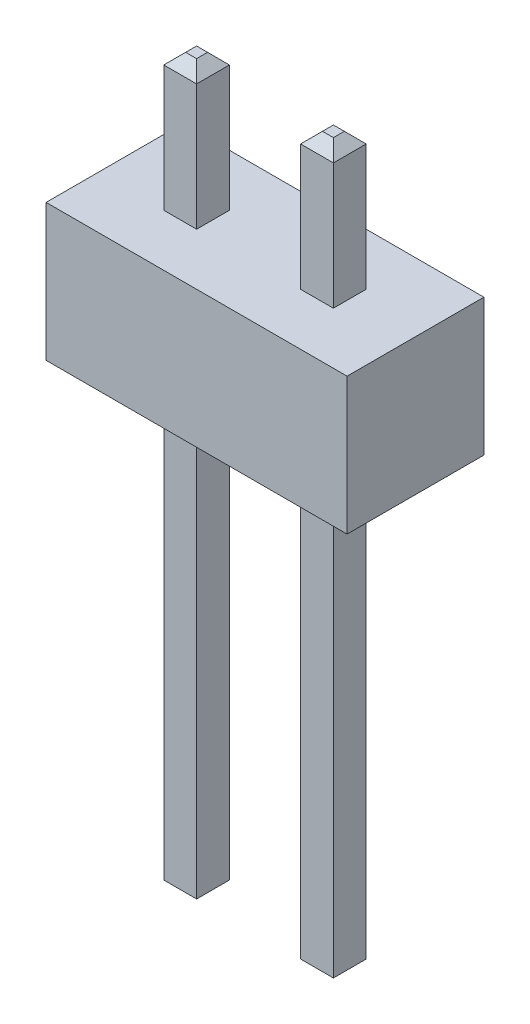
ISO-10303-21;
HEADER;
FILE_DESCRIPTION(('STEP AP214'),'2;1');
FILE_NAME('part.step','',(''),(''),'','','');
FILE_SCHEMA(('AUTOMOTIVE_DESIGN { 1 0 10303 214 1 1 1 1 }'));
ENDSEC;
DATA;
#1=APPLICATION_CONTEXT('core data for automotive mechanical design processes');
#2=APPLICATION_PROTOCOL_DEFINITION('international standard','automotive_design',2000,#1);
#3=PRODUCT_CONTEXT('',#1,'mechanical');
#4=PRODUCT('Part','Part','',(#3));
#5=PRODUCT_RELATED_PRODUCT_CATEGORY('part','',(#4));
#6=PRODUCT_DEFINITION_FORMATION('','',#4);
#7=PRODUCT_DEFINITION_CONTEXT('part definition',#1,'design');
#8=PRODUCT_DEFINITION('design','',#6,#7);
#9=PRODUCT_DEFINITION_SHAPE('','',#8);
#10=(LENGTH_UNIT() NAMED_UNIT(*) SI_UNIT(.MILLI.,.METRE.));
#11=(NAMED_UNIT(*) PLANE_ANGLE_UNIT() SI_UNIT($,.RADIAN.));
#12=(NAMED_UNIT(*) SI_UNIT($,.STERADIAN.) SOLID_ANGLE_UNIT());
#13=UNCERTAINTY_MEASURE_WITH_UNIT(LENGTH_MEASURE(1.E-05),#10,'distance_accuracy_value','');
#14=(GEOMETRIC_REPRESENTATION_CONTEXT(3) GLOBAL_UNCERTAINTY_ASSIGNED_CONTEXT((#13)) GLOBAL_UNIT_ASSIGNED_CONTEXT((#10,
#11,#12)) REPRESENTATION_CONTEXT('',''));
#15=CARTESIAN_POINT('',(0.,0.,0.));
#16=DIRECTION('',(0.,0.,1.));
#17=DIRECTION('',(1.,0.,0.));
#18=AXIS2_PLACEMENT_3D('',#15,#16,#17);
#19=CARTESIAN_POINT('',(0.,2.5,0.));
#20=DIRECTION('',(0.,1.,0.));
#21=DIRECTION('',(0.,0.,1.));
#22=AXIS2_PLACEMENT_3D('',#19,#20,#21);
#23=PLANE('',#22);
#24=DIRECTION('',(0.,0.,1.));
#25=VECTOR('',#24,1.);
#26=CARTESIAN_POINT('',(-1.55,2.5,0.));
#27=LINE('',#26,#25);
#28=CARTESIAN_POINT('',(-1.55,2.5,-0.3));
#29=VERTEX_POINT('',#28);
#30=CARTESIAN_POINT('',(-1.55,2.5,0.3));
#31=VERTEX_POINT('',#30);
#32=EDGE_CURVE('E271',#29,#31,#27,.T.);
#33=ORIENTED_EDGE('',*,*,#32,.F.);
#34=DIRECTION('',(-1.,0.,0.));
#35=VECTOR('',#34,1.);
#36=CARTESIAN_POINT('',(0.,2.5,-0.3));
#37=LINE('',#36,#35);
#38=CARTESIAN_POINT('',(-0.95,2.5,-0.3));
#39=VERTEX_POINT('',#38);
#40=EDGE_CURVE('E268',#39,#29,#37,.T.);
#41=ORIENTED_EDGE('',*,*,#40,.F.);
#42=DIRECTION('',(0.,0.,-1.));
#43=VECTOR('',#42,1.);
#44=CARTESIAN_POINT('',(-0.95,2.5,0.));
#45=LINE('',#44,#43);
#46=CARTESIAN_POINT('',(-0.95,2.5,0.3));
#47=VERTEX_POINT('',#46);
#48=EDGE_CURVE('E265',#47,#39,#45,.T.);
#49=ORIENTED_EDGE('',*,*,#48,.F.);
#50=DIRECTION('',(1.,0.,0.));
#51=VECTOR('',#50,1.);
#52=CARTESIAN_POINT('',(0.,2.5,0.3));
#53=LINE('',#52,#51);
#54=EDGE_CURVE('E252',#31,#47,#53,.T.);
#55=ORIENTED_EDGE('',*,*,#54,.F.);
#56=EDGE_LOOP('',(#33,#41,#49,#55));
#57=FACE_BOUND('',#56,.T.);
#58=DIRECTION('',(0.,0.,1.));
#59=VECTOR('',#58,1.);
#60=CARTESIAN_POINT('',(-2.75,2.5,-1.25));
#61=LINE('',#60,#59);
#62=CARTESIAN_POINT('',(-2.75,2.5,-1.25));
#63=VERTEX_POINT('',#62);
#64=CARTESIAN_POINT('',(-2.75,2.5,1.25));
#65=VERTEX_POINT('',#64);
#66=EDGE_CURVE('E275',#63,#65,#61,.T.);
#67=ORIENTED_EDGE('',*,*,#66,.T.);
#68=DIRECTION('',(1.,0.,0.));
#69=VECTOR('',#68,1.);
#70=CARTESIAN_POINT('',(-2.75,2.5,1.25));
#71=LINE('',#70,#69);
#72=CARTESIAN_POINT('',(2.75,2.5,1.25));
#73=VERTEX_POINT('',#72);
#74=EDGE_CURVE('E278',#65,#73,#71,.T.);
#75=ORIENTED_EDGE('',*,*,#74,.T.);
#76=DIRECTION('',(0.,0.,-1.));
#77=VECTOR('',#76,1.);
#78=CARTESIAN_POINT('',(2.75,2.5,-1.25));
#79=LINE('',#78,#77);
#80=CARTESIAN_POINT('',(2.75,2.5,-1.25));
#81=VERTEX_POINT('',#80);
#82=EDGE_CURVE('E281',#73,#81,#79,.T.);
#83=ORIENTED_EDGE('',*,*,#82,.T.);
#84=DIRECTION('',(-1.,0.,0.));
#85=VECTOR('',#84,1.);
#86=CARTESIAN_POINT('',(-2.75,2.5,-1.25));
#87=LINE('',#86,#85);
#88=EDGE_CURVE('E283',#81,#63,#87,.T.);
#89=ORIENTED_EDGE('',*,*,#88,.T.);
#90=EDGE_LOOP('',(#67,#75,#83,#89));
#91=FACE_BOUND('',#90,.T.);
#92=DIRECTION('',(1.,0.,0.));
#93=VECTOR('',#92,1.);
#94=CARTESIAN_POINT('',(0.,2.5,-0.3));
#95=LINE('',#94,#93);
#96=CARTESIAN_POINT('',(0.95,2.5,-0.3));
#97=VERTEX_POINT('',#96);
#98=CARTESIAN_POINT('',(1.55,2.5,-0.3));
#99=VERTEX_POINT('',#98);
#100=EDGE_CURVE('E221',#97,#99,#95,.T.);
#101=ORIENTED_EDGE('',*,*,#100,.T.);
#102=DIRECTION('',(0.,0.,1.));
#103=VECTOR('',#102,1.);
#104=CARTESIAN_POINT('',(1.55,2.5,0.));
#105=LINE('',#104,#103);
#106=CARTESIAN_POINT('',(1.55,2.5,0.3));
#107=VERTEX_POINT('',#106);
#108=EDGE_CURVE('E244',#99,#107,#105,.T.);
#109=ORIENTED_EDGE('',*,*,#108,.T.);
#110=DIRECTION('',(-1.,0.,0.));
#111=VECTOR('',#110,1.);
#112=CARTESIAN_POINT('',(0.,2.5,0.3));
#113=LINE('',#112,#111);
#114=CARTESIAN_POINT('',(0.95,2.5,0.3));
#115=VERTEX_POINT('',#114);
#116=EDGE_CURVE('E242',#107,#115,#113,.T.);
#117=ORIENTED_EDGE('',*,*,#116,.T.);
#118=DIRECTION('',(0.,0.,-1.));
#119=VECTOR('',#118,1.);
#120=CARTESIAN_POINT('',(0.95,2.5,0.));
#121=LINE('',#120,#119);
#122=EDGE_CURVE('E232',#115,#97,#121,.T.);
#123=ORIENTED_EDGE('',*,*,#122,.T.);
#124=EDGE_LOOP('',(#101,#109,#117,#123));
#125=FACE_BOUND('',#124,.T.);
#126=ADVANCED_FACE('F33',(#57,#91,#125),#23,.T.);
#127=CARTESIAN_POINT('',(0.,0.,0.));
#128=DIRECTION('',(0.,1.,0.));
#129=DIRECTION('',(0.,0.,1.));
#130=AXIS2_PLACEMENT_3D('',#127,#128,#129);
#131=PLANE('',#130);
#132=DIRECTION('',(0.,0.,1.));
#133=VECTOR('',#132,1.);
#134=CARTESIAN_POINT('',(-2.75,0.,-1.25));
#135=LINE('',#134,#133);
#136=CARTESIAN_POINT('',(-2.75,0.,-1.25));
#137=VERTEX_POINT('',#136);
#138=CARTESIAN_POINT('',(-2.75,0.,1.25));
#139=VERTEX_POINT('',#138);
#140=EDGE_CURVE('E274',#137,#139,#135,.T.);
#141=ORIENTED_EDGE('',*,*,#140,.F.);
#142=DIRECTION('',(-1.,0.,0.));
#143=VECTOR('',#142,1.);
#144=CARTESIAN_POINT('',(-2.75,0.,-1.25));
#145=LINE('',#144,#143);
#146=CARTESIAN_POINT('',(2.75,0.,-1.25));
#147=VERTEX_POINT('',#146);
#148=EDGE_CURVE('E279',#147,#137,#145,.T.);
#149=ORIENTED_EDGE('',*,*,#148,.F.);
#150=DIRECTION('',(0.,0.,-1.));
#151=VECTOR('',#150,1.);
#152=CARTESIAN_POINT('',(2.75,0.,-1.25));
#153=LINE('',#152,#151);
#154=CARTESIAN_POINT('',(2.75,0.,1.25));
#155=VERTEX_POINT('',#154);
#156=EDGE_CURVE('E290',#155,#147,#153,.T.);
#157=ORIENTED_EDGE('',*,*,#156,.F.);
#158=DIRECTION('',(1.,0.,0.));
#159=VECTOR('',#158,1.);
#160=CARTESIAN_POINT('',(-2.75,0.,1.25));
#161=LINE('',#160,#159);
#162=EDGE_CURVE('E288',#139,#155,#161,.T.);
#163=ORIENTED_EDGE('',*,*,#162,.F.);
#164=EDGE_LOOP('',(#141,#149,#157,#163));
#165=FACE_BOUND('',#164,.T.);
#166=DIRECTION('',(-1.,0.,0.));
#167=VECTOR('',#166,1.);
#168=CARTESIAN_POINT('',(0.,0.,-0.3));
#169=LINE('',#168,#167);
#170=CARTESIAN_POINT('',(-0.95,0.,-0.3));
#171=VERTEX_POINT('',#170);
#172=CARTESIAN_POINT('',(-1.55,0.,-0.3));
#173=VERTEX_POINT('',#172);
#174=EDGE_CURVE('E310',#171,#173,#169,.T.);
#175=ORIENTED_EDGE('',*,*,#174,.T.);
#176=DIRECTION('',(0.,0.,1.));
#177=VECTOR('',#176,1.);
#178=CARTESIAN_POINT('',(-1.55,0.,0.));
#179=LINE('',#178,#177);
#180=CARTESIAN_POINT('',(-1.55,0.,0.3));
#181=VERTEX_POINT('',#180);
#182=EDGE_CURVE('E313',#173,#181,#179,.T.);
#183=ORIENTED_EDGE('',*,*,#182,.T.);
#184=DIRECTION('',(1.,0.,0.));
#185=VECTOR('',#184,1.);
#186=CARTESIAN_POINT('',(0.,0.,0.3));
#187=LINE('',#186,#185);
#188=CARTESIAN_POINT('',(-0.95,0.,0.3));
#189=VERTEX_POINT('',#188);
#190=EDGE_CURVE('E304',#181,#189,#187,.T.);
#191=ORIENTED_EDGE('',*,*,#190,.T.);
#192=DIRECTION('',(0.,0.,-1.));
#193=VECTOR('',#192,1.);
#194=CARTESIAN_POINT('',(-0.95,0.,0.));
#195=LINE('',#194,#193);
#196=EDGE_CURVE('E307',#189,#171,#195,.T.);
#197=ORIENTED_EDGE('',*,*,#196,.T.);
#198=EDGE_LOOP('',(#175,#183,#191,#197));
#199=FACE_BOUND('',#198,.T.);
#200=DIRECTION('',(0.,0.,1.));
#201=VECTOR('',#200,1.);
#202=CARTESIAN_POINT('',(1.55,0.,0.));
#203=LINE('',#202,#201);
#204=CARTESIAN_POINT('',(1.55,0.,-0.3));
#205=VERTEX_POINT('',#204);
#206=CARTESIAN_POINT('',(1.55,0.,0.3));
#207=VERTEX_POINT('',#206);
#208=EDGE_CURVE('E380',#205,#207,#203,.T.);
#209=ORIENTED_EDGE('',*,*,#208,.F.);
#210=DIRECTION('',(1.,0.,0.));
#211=VECTOR('',#210,1.);
#212=CARTESIAN_POINT('',(0.,0.,-0.3));
#213=LINE('',#212,#211);
#214=CARTESIAN_POINT('',(0.95,0.,-0.3));
#215=VERTEX_POINT('',#214);
#216=EDGE_CURVE('E352',#215,#205,#213,.T.);
#217=ORIENTED_EDGE('',*,*,#216,.F.);
#218=DIRECTION('',(0.,0.,-1.));
#219=VECTOR('',#218,1.);
#220=CARTESIAN_POINT('',(0.95,0.,0.));
#221=LINE('',#220,#219);
#222=CARTESIAN_POINT('',(0.95,0.,0.3));
#223=VERTEX_POINT('',#222);
#224=EDGE_CURVE('E374',#223,#215,#221,.T.);
#225=ORIENTED_EDGE('',*,*,#224,.F.);
#226=DIRECTION('',(-1.,0.,0.));
#227=VECTOR('',#226,1.);
#228=CARTESIAN_POINT('',(0.,0.,0.3));
#229=LINE('',#228,#227);
#230=EDGE_CURVE('E377',#207,#223,#229,.T.);
#231=ORIENTED_EDGE('',*,*,#230,.F.);
#232=EDGE_LOOP('',(#209,#217,#225,#231));
#233=FACE_BOUND('',#232,.T.);
#234=ADVANCED_FACE('F471',(#165,#199,#233),#131,.F.);
#235=CARTESIAN_POINT('',(-2.75,2.5,-1.25));
#236=DIRECTION('',(1.,0.,0.));
#237=DIRECTION('',(0.,0.,-1.));
#238=AXIS2_PLACEMENT_3D('',#235,#236,#237);
#239=PLANE('',#238);
#240=ORIENTED_EDGE('',*,*,#140,.T.);
#241=DIRECTION('',(0.,-1.,0.));
#242=VECTOR('',#241,1.);
#243=CARTESIAN_POINT('',(-2.75,2.5,1.25));
#244=LINE('',#243,#242);
#245=EDGE_CURVE('E301',#65,#139,#244,.T.);
#246=ORIENTED_EDGE('',*,*,#245,.F.);
#247=ORIENTED_EDGE('',*,*,#66,.F.);
#248=DIRECTION('',(0.,-1.,0.));
#249=VECTOR('',#248,1.);
#250=CARTESIAN_POINT('',(-2.75,2.5,-1.25));
#251=LINE('',#250,#249);
#252=EDGE_CURVE('E285',#63,#137,#251,.T.);
#253=ORIENTED_EDGE('',*,*,#252,.T.);
#254=EDGE_LOOP('',(#240,#246,#247,#253));
#255=FACE_BOUND('',#254,.T.);
#256=ADVANCED_FACE('F477',(#255),#239,.F.);
#257=CARTESIAN_POINT('',(-2.75,2.5,1.25));
#258=DIRECTION('',(0.,0.,-1.));
#259=DIRECTION('',(-1.,0.,0.));
#260=AXIS2_PLACEMENT_3D('',#257,#258,#259);
#261=PLANE('',#260);
#262=ORIENTED_EDGE('',*,*,#162,.T.);
#263=DIRECTION('',(0.,-1.,0.));
#264=VECTOR('',#263,1.);
#265=CARTESIAN_POINT('',(2.75,2.5,1.25));
#266=LINE('',#265,#264);
#267=EDGE_CURVE('E298',#73,#155,#266,.T.);
#268=ORIENTED_EDGE('',*,*,#267,.F.);
#269=ORIENTED_EDGE('',*,*,#74,.F.);
#270=ORIENTED_EDGE('',*,*,#245,.T.);
#271=EDGE_LOOP('',(#262,#268,#269,#270));
#272=FACE_BOUND('',#271,.T.);
#273=ADVANCED_FACE('F493',(#272),#261,.F.);
#274=CARTESIAN_POINT('',(2.75,2.5,-1.25));
#275=DIRECTION('',(-1.,0.,0.));
#276=DIRECTION('',(0.,0.,1.));
#277=AXIS2_PLACEMENT_3D('',#274,#275,#276);
#278=PLANE('',#277);
#279=ORIENTED_EDGE('',*,*,#156,.T.);
#280=DIRECTION('',(0.,-1.,0.));
#281=VECTOR('',#280,1.);
#282=CARTESIAN_POINT('',(2.75,2.5,-1.25));
#283=LINE('',#282,#281);
#284=EDGE_CURVE('E295',#81,#147,#283,.T.);
#285=ORIENTED_EDGE('',*,*,#284,.F.);
#286=ORIENTED_EDGE('',*,*,#82,.F.);
#287=ORIENTED_EDGE('',*,*,#267,.T.);
#288=EDGE_LOOP('',(#279,#285,#286,#287));
#289=FACE_BOUND('',#288,.T.);
#290=ADVANCED_FACE('F489',(#289),#278,.F.);
#291=CARTESIAN_POINT('',(-2.75,2.5,-1.25));
#292=DIRECTION('',(0.,0.,1.));
#293=DIRECTION('',(1.,0.,0.));
#294=AXIS2_PLACEMENT_3D('',#291,#292,#293);
#295=PLANE('',#294);
#296=ORIENTED_EDGE('',*,*,#148,.T.);
#297=ORIENTED_EDGE('',*,*,#252,.F.);
#298=ORIENTED_EDGE('',*,*,#88,.F.);
#299=ORIENTED_EDGE('',*,*,#284,.T.);
#300=EDGE_LOOP('',(#296,#297,#298,#299));
#301=FACE_BOUND('',#300,.T.);
#302=ADVANCED_FACE('F485',(#301),#295,.F.);
#303=CARTESIAN_POINT('',(0.,-8.3,0.));
#304=DIRECTION('',(0.,1.,0.));
#305=DIRECTION('',(0.,0.,1.));
#306=AXIS2_PLACEMENT_3D('',#303,#304,#305);
#307=PLANE('',#306);
#308=DIRECTION('',(-1.,0.,0.));
#309=VECTOR('',#308,1.);
#310=CARTESIAN_POINT('',(-1.55,-8.3,0.100000000000001));
#311=LINE('',#310,#309);
#312=CARTESIAN_POINT('',(-1.15,-8.3,0.100000000000001));
#313=VERTEX_POINT('',#312);
#314=CARTESIAN_POINT('',(-1.35,-8.3,0.100000000000001));
#315=VERTEX_POINT('',#314);
#316=EDGE_CURVE('E319',#313,#315,#311,.T.);
#317=ORIENTED_EDGE('',*,*,#316,.T.);
#318=DIRECTION('',(0.,0.,-1.));
#319=VECTOR('',#318,1.);
#320=CARTESIAN_POINT('',(-1.35,-8.3,-0.3));
#321=LINE('',#320,#319);
#322=CARTESIAN_POINT('',(-1.35,-8.3,-0.100000000000001));
#323=VERTEX_POINT('',#322);
#324=EDGE_CURVE('E325',#315,#323,#321,.T.);
#325=ORIENTED_EDGE('',*,*,#324,.T.);
#326=DIRECTION('',(1.,0.,0.));
#327=VECTOR('',#326,1.);
#328=CARTESIAN_POINT('',(-0.95,-8.3,-0.100000000000001));
#329=LINE('',#328,#327);
#330=CARTESIAN_POINT('',(-1.15,-8.3,-0.100000000000001));
#331=VERTEX_POINT('',#330);
#332=EDGE_CURVE('E323',#323,#331,#329,.T.);
#333=ORIENTED_EDGE('',*,*,#332,.T.);
#334=DIRECTION('',(0.,0.,1.));
#335=VECTOR('',#334,1.);
#336=CARTESIAN_POINT('',(-1.15,-8.3,0.3));
#337=LINE('',#336,#335);
#338=EDGE_CURVE('E321',#331,#313,#337,.T.);
#339=ORIENTED_EDGE('',*,*,#338,.T.);
#340=EDGE_LOOP('',(#317,#325,#333,#339));
#341=FACE_BOUND('',#340,.T.);
#342=ADVANCED_FACE('F488',(#341),#307,.F.);
#343=CARTESIAN_POINT('',(-1.55,-8.3,0.3));
#344=DIRECTION('',(0.,0.,1.));
#345=DIRECTION('',(1.,0.,0.));
#346=AXIS2_PLACEMENT_3D('',#343,#344,#345);
#347=PLANE('',#346);
#348=DIRECTION('',(0.,1.,0.));
#349=VECTOR('',#348,1.);
#350=CARTESIAN_POINT('',(-1.55,-8.3,0.3));
#351=LINE('',#350,#349);
#352=CARTESIAN_POINT('',(-1.55,-8.1,0.3));
#353=VERTEX_POINT('',#352);
#354=EDGE_CURVE('E260',#353,#181,#351,.T.);
#355=ORIENTED_EDGE('',*,*,#354,.F.);
#356=DIRECTION('',(1.,0.,0.));
#357=VECTOR('',#356,1.);
#358=CARTESIAN_POINT('',(-0.95,-8.1,0.3));
#359=LINE('',#358,#357);
#360=CARTESIAN_POINT('',(-0.95,-8.1,0.3));
#361=VERTEX_POINT('',#360);
#362=EDGE_CURVE('E332',#353,#361,#359,.T.);
#363=ORIENTED_EDGE('',*,*,#362,.T.);
#364=DIRECTION('',(0.,1.,0.));
#365=VECTOR('',#364,1.);
#366=CARTESIAN_POINT('',(-0.95,-8.3,0.3));
#367=LINE('',#366,#365);
#368=EDGE_CURVE('E257',#361,#189,#367,.T.);
#369=ORIENTED_EDGE('',*,*,#368,.T.);
#370=ORIENTED_EDGE('',*,*,#190,.F.);
#371=EDGE_LOOP('',(#355,#363,#369,#370));
#372=FACE_BOUND('',#371,.T.);
#373=ADVANCED_FACE('F720',(#372),#347,.T.);
#374=CARTESIAN_POINT('',(-0.95,-8.3,-0.3));
#375=DIRECTION('',(1.,0.,0.));
#376=DIRECTION('',(0.,0.,-1.));
#377=AXIS2_PLACEMENT_3D('',#374,#375,#376);
#378=PLANE('',#377);
#379=ORIENTED_EDGE('',*,*,#368,.F.);
#380=DIRECTION('',(0.,0.,-1.));
#381=VECTOR('',#380,1.);
#382=CARTESIAN_POINT('',(-0.95,-8.1,-0.3));
#383=LINE('',#382,#381);
#384=CARTESIAN_POINT('',(-0.95,-8.1,-0.3));
#385=VERTEX_POINT('',#384);
#386=EDGE_CURVE('E330',#361,#385,#383,.T.);
#387=ORIENTED_EDGE('',*,*,#386,.T.);
#388=DIRECTION('',(0.,1.,0.));
#389=VECTOR('',#388,1.);
#390=CARTESIAN_POINT('',(-0.95,-8.3,-0.3));
#391=LINE('',#390,#389);
#392=EDGE_CURVE('E254',#385,#171,#391,.T.);
#393=ORIENTED_EDGE('',*,*,#392,.T.);
#394=ORIENTED_EDGE('',*,*,#196,.F.);
#395=EDGE_LOOP('',(#379,#387,#393,#394));
#396=FACE_BOUND('',#395,.T.);
#397=ADVANCED_FACE('F731',(#396),#378,.T.);
#398=CARTESIAN_POINT('',(-1.55,-8.3,-0.3));
#399=DIRECTION('',(0.,0.,-1.));
#400=DIRECTION('',(-1.,0.,0.));
#401=AXIS2_PLACEMENT_3D('',#398,#399,#400);
#402=PLANE('',#401);
#403=ORIENTED_EDGE('',*,*,#392,.F.);
#404=DIRECTION('',(-1.,0.,0.));
#405=VECTOR('',#404,1.);
#406=CARTESIAN_POINT('',(-1.55,-8.1,-0.3));
#407=LINE('',#406,#405);
#408=CARTESIAN_POINT('',(-1.55,-8.1,-0.3));
#409=VERTEX_POINT('',#408);
#410=EDGE_CURVE('E328',#385,#409,#407,.T.);
#411=ORIENTED_EDGE('',*,*,#410,.T.);
#412=DIRECTION('',(0.,1.,0.));
#413=VECTOR('',#412,1.);
#414=CARTESIAN_POINT('',(-1.55,-8.3,-0.3));
#415=LINE('',#414,#413);
#416=EDGE_CURVE('E250',#409,#173,#415,.T.);
#417=ORIENTED_EDGE('',*,*,#416,.T.);
#418=ORIENTED_EDGE('',*,*,#174,.F.);
#419=EDGE_LOOP('',(#403,#411,#417,#418));
#420=FACE_BOUND('',#419,.T.);
#421=ADVANCED_FACE('F741',(#420),#402,.T.);
#422=CARTESIAN_POINT('',(-1.55,-8.3,-0.3));
#423=DIRECTION('',(-1.,0.,0.));
#424=DIRECTION('',(0.,0.,1.));
#425=AXIS2_PLACEMENT_3D('',#422,#423,#424);
#426=PLANE('',#425);
#427=ORIENTED_EDGE('',*,*,#416,.F.);
#428=DIRECTION('',(0.,0.,1.));
#429=VECTOR('',#428,1.);
#430=CARTESIAN_POINT('',(-1.55,-8.1,0.3));
#431=LINE('',#430,#429);
#432=EDGE_CURVE('E316',#409,#353,#431,.T.);
#433=ORIENTED_EDGE('',*,*,#432,.T.);
#434=ORIENTED_EDGE('',*,*,#354,.T.);
#435=ORIENTED_EDGE('',*,*,#182,.F.);
#436=EDGE_LOOP('',(#427,#433,#434,#435));
#437=FACE_BOUND('',#436,.T.);
#438=ADVANCED_FACE('F749',(#437),#426,.T.);
#439=CARTESIAN_POINT('',(-1.55,4.8,0.3));
#440=VERTEX_POINT('',#439);
#441=EDGE_CURVE('E262',#31,#440,#351,.T.);
#442=ORIENTED_EDGE('',*,*,#441,.T.);
#443=DIRECTION('',(0.,0.,-1.));
#444=VECTOR('',#443,1.);
#445=CARTESIAN_POINT('',(-1.55,4.8,-0.3));
#446=LINE('',#445,#444);
#447=CARTESIAN_POINT('',(-1.55,4.8,-0.3));
#448=VERTEX_POINT('',#447);
#449=EDGE_CURVE('E346',#440,#448,#446,.T.);
#450=ORIENTED_EDGE('',*,*,#449,.T.);
#451=EDGE_CURVE('E253',#29,#448,#415,.T.);
#452=ORIENTED_EDGE('',*,*,#451,.F.);
#453=ORIENTED_EDGE('',*,*,#32,.T.);
#454=EDGE_LOOP('',(#442,#450,#452,#453));
#455=FACE_BOUND('',#454,.T.);
#456=ADVANCED_FACE('F482',(#455),#426,.T.);
#457=ORIENTED_EDGE('',*,*,#451,.T.);
#458=DIRECTION('',(1.,0.,0.));
#459=VECTOR('',#458,1.);
#460=CARTESIAN_POINT('',(-1.55,4.8,-0.3));
#461=LINE('',#460,#459);
#462=CARTESIAN_POINT('',(-0.95,4.8,-0.3));
#463=VERTEX_POINT('',#462);
#464=EDGE_CURVE('E343',#448,#463,#461,.T.);
#465=ORIENTED_EDGE('',*,*,#464,.T.);
#466=EDGE_CURVE('E256',#39,#463,#391,.T.);
#467=ORIENTED_EDGE('',*,*,#466,.F.);
#468=ORIENTED_EDGE('',*,*,#40,.T.);
#469=EDGE_LOOP('',(#457,#465,#467,#468));
#470=FACE_BOUND('',#469,.T.);
#471=ADVANCED_FACE('F728',(#470),#402,.T.);
#472=ORIENTED_EDGE('',*,*,#466,.T.);
#473=DIRECTION('',(0.,0.,1.));
#474=VECTOR('',#473,1.);
#475=CARTESIAN_POINT('',(-0.95,4.8,-0.3));
#476=LINE('',#475,#474);
#477=CARTESIAN_POINT('',(-0.95,4.8,0.3));
#478=VERTEX_POINT('',#477);
#479=EDGE_CURVE('E350',#463,#478,#476,.T.);
#480=ORIENTED_EDGE('',*,*,#479,.T.);
#481=EDGE_CURVE('E259',#47,#478,#367,.T.);
#482=ORIENTED_EDGE('',*,*,#481,.F.);
#483=ORIENTED_EDGE('',*,*,#48,.T.);
#484=EDGE_LOOP('',(#472,#480,#482,#483));
#485=FACE_BOUND('',#484,.T.);
#486=ADVANCED_FACE('F718',(#485),#378,.T.);
#487=ORIENTED_EDGE('',*,*,#481,.T.);
#488=DIRECTION('',(-1.,0.,0.));
#489=VECTOR('',#488,1.);
#490=CARTESIAN_POINT('',(-1.55,4.8,0.3));
#491=LINE('',#490,#489);
#492=EDGE_CURVE('E348',#478,#440,#491,.T.);
#493=ORIENTED_EDGE('',*,*,#492,.T.);
#494=ORIENTED_EDGE('',*,*,#441,.F.);
#495=ORIENTED_EDGE('',*,*,#54,.T.);
#496=EDGE_LOOP('',(#487,#493,#494,#495));
#497=FACE_BOUND('',#496,.T.);
#498=ADVANCED_FACE('F708',(#497),#347,.T.);
#499=CARTESIAN_POINT('',(0.,5.,0.));
#500=DIRECTION('',(0.,1.,0.));
#501=DIRECTION('',(0.,0.,1.));
#502=AXIS2_PLACEMENT_3D('',#499,#500,#501);
#503=PLANE('',#502);
#504=DIRECTION('',(0.,0.,-1.));
#505=VECTOR('',#504,1.);
#506=CARTESIAN_POINT('',(-1.15,5.,0.));
#507=LINE('',#506,#505);
#508=CARTESIAN_POINT('',(-1.15,5.,0.0999999999999995));
#509=VERTEX_POINT('',#508);
#510=CARTESIAN_POINT('',(-1.15,5.,-0.0999999999999995));
#511=VERTEX_POINT('',#510);
#512=EDGE_CURVE('E334',#509,#511,#507,.T.);
#513=ORIENTED_EDGE('',*,*,#512,.T.);
#514=DIRECTION('',(-1.,0.,0.));
#515=VECTOR('',#514,1.);
#516=CARTESIAN_POINT('',(0.,5.,-0.0999999999999995));
#517=LINE('',#516,#515);
#518=CARTESIAN_POINT('',(-1.35,5.,-0.0999999999999995));
#519=VERTEX_POINT('',#518);
#520=EDGE_CURVE('E340',#511,#519,#517,.T.);
#521=ORIENTED_EDGE('',*,*,#520,.T.);
#522=DIRECTION('',(0.,0.,1.));
#523=VECTOR('',#522,1.);
#524=CARTESIAN_POINT('',(-1.35,5.,0.));
#525=LINE('',#524,#523);
#526=CARTESIAN_POINT('',(-1.35,5.,0.0999999999999995));
#527=VERTEX_POINT('',#526);
#528=EDGE_CURVE('E338',#519,#527,#525,.T.);
#529=ORIENTED_EDGE('',*,*,#528,.T.);
#530=DIRECTION('',(1.,0.,0.));
#531=VECTOR('',#530,1.);
#532=CARTESIAN_POINT('',(0.,5.,0.0999999999999995));
#533=LINE('',#532,#531);
#534=EDGE_CURVE('E336',#527,#509,#533,.T.);
#535=ORIENTED_EDGE('',*,*,#534,.T.);
#536=EDGE_LOOP('',(#513,#521,#529,#535));
#537=FACE_BOUND('',#536,.T.);
#538=ADVANCED_FACE('F517',(#537),#503,.T.);
#539=CARTESIAN_POINT('',(-0.95,-8.1,-0.3));
#540=DIRECTION('',(0.707106781186551,-0.707106781186544,0.));
#541=DIRECTION('',(0.,0.,1.));
#542=AXIS2_PLACEMENT_3D('',#539,#540,#541);
#543=PLANE('',#542);
#544=DIRECTION('',(0.577350269189624,0.577350269189629,0.577350269189624));
#545=VECTOR('',#544,1.);
#546=CARTESIAN_POINT('',(-1.15,-8.3,0.100000000000001));
#547=LINE('',#546,#545);
#548=EDGE_CURVE('E358',#313,#361,#547,.T.);
#549=ORIENTED_EDGE('',*,*,#548,.F.);
#550=ORIENTED_EDGE('',*,*,#338,.F.);
#551=DIRECTION('',(0.577350269189624,0.577350269189629,-0.577350269189624));
#552=VECTOR('',#551,1.);
#553=CARTESIAN_POINT('',(-0.95,-8.1,-0.3));
#554=LINE('',#553,#552);
#555=EDGE_CURVE('E361',#385,#331,#554,.F.);
#556=ORIENTED_EDGE('',*,*,#555,.F.);
#557=ORIENTED_EDGE('',*,*,#386,.F.);
#558=EDGE_LOOP('',(#549,#550,#556,#557));
#559=FACE_BOUND('',#558,.T.);
#560=ADVANCED_FACE('F513',(#559),#543,.T.);
#561=CARTESIAN_POINT('',(-1.55,-8.1,-0.3));
#562=DIRECTION('',(0.,-0.707106781186544,-0.707106781186551));
#563=DIRECTION('',(1.,0.,0.));
#564=AXIS2_PLACEMENT_3D('',#561,#562,#563);
#565=PLANE('',#564);
#566=ORIENTED_EDGE('',*,*,#555,.T.);
#567=ORIENTED_EDGE('',*,*,#332,.F.);
#568=DIRECTION('',(-0.577350269189624,0.577350269189629,-0.577350269189624));
#569=VECTOR('',#568,1.);
#570=CARTESIAN_POINT('',(-1.55,-8.1,-0.3));
#571=LINE('',#570,#569);
#572=EDGE_CURVE('E355',#409,#323,#571,.F.);
#573=ORIENTED_EDGE('',*,*,#572,.F.);
#574=ORIENTED_EDGE('',*,*,#410,.F.);
#575=EDGE_LOOP('',(#566,#567,#573,#574));
#576=FACE_BOUND('',#575,.T.);
#577=ADVANCED_FACE('F509',(#576),#565,.T.);
#578=CARTESIAN_POINT('',(-1.55,-8.1,0.3));
#579=DIRECTION('',(0.,-0.707106781186544,0.707106781186551));
#580=DIRECTION('',(-1.,0.,0.));
#581=AXIS2_PLACEMENT_3D('',#578,#579,#580);
#582=PLANE('',#581);
#583=ORIENTED_EDGE('',*,*,#548,.T.);
#584=ORIENTED_EDGE('',*,*,#362,.F.);
#585=DIRECTION('',(0.577350269189624,-0.577350269189629,-0.577350269189624));
#586=VECTOR('',#585,1.);
#587=CARTESIAN_POINT('',(-1.55,-8.1,0.3));
#588=LINE('',#587,#586);
#589=EDGE_CURVE('E353',#315,#353,#588,.F.);
#590=ORIENTED_EDGE('',*,*,#589,.F.);
#591=ORIENTED_EDGE('',*,*,#316,.F.);
#592=EDGE_LOOP('',(#583,#584,#590,#591));
#593=FACE_BOUND('',#592,.T.);
#594=ADVANCED_FACE('F505',(#593),#582,.T.);
#595=CARTESIAN_POINT('',(-1.55,-8.1,-0.3));
#596=DIRECTION('',(-0.707106781186551,-0.707106781186544,0.));
#597=DIRECTION('',(0.,0.,-1.));
#598=AXIS2_PLACEMENT_3D('',#595,#596,#597);
#599=PLANE('',#598);
#600=ORIENTED_EDGE('',*,*,#572,.T.);
#601=ORIENTED_EDGE('',*,*,#324,.F.);
#602=ORIENTED_EDGE('',*,*,#589,.T.);
#603=ORIENTED_EDGE('',*,*,#432,.F.);
#604=EDGE_LOOP('',(#600,#601,#602,#603));
#605=FACE_BOUND('',#604,.T.);
#606=ADVANCED_FACE('F501',(#605),#599,.T.);
#607=CARTESIAN_POINT('',(0.,5.,0.0999999999999995));
#608=DIRECTION('',(0.,-0.707106781186549,-0.707106781186546));
#609=DIRECTION('',(1.,0.,0.));
#610=AXIS2_PLACEMENT_3D('',#607,#608,#609);
#611=PLANE('',#610);
#612=DIRECTION('',(-0.577350269189627,-0.577350269189624,0.577350269189627));
#613=VECTOR('',#612,1.);
#614=CARTESIAN_POINT('',(-0.899999999999998,5.45,-0.350000000000001));
#615=LINE('',#614,#613);
#616=EDGE_CURVE('E367',#440,#527,#615,.F.);
#617=ORIENTED_EDGE('',*,*,#616,.F.);
#618=ORIENTED_EDGE('',*,*,#492,.F.);
#619=DIRECTION('',(0.577350269189627,-0.577350269189624,0.577350269189627));
#620=VECTOR('',#619,1.);
#621=CARTESIAN_POINT('',(-1.18333333333333,5.03333333333333,0.0666666666666663));
#622=LINE('',#621,#620);
#623=EDGE_CURVE('E356',#509,#478,#622,.T.);
#624=ORIENTED_EDGE('',*,*,#623,.F.);
#625=ORIENTED_EDGE('',*,*,#534,.F.);
#626=EDGE_LOOP('',(#617,#618,#624,#625));
#627=FACE_BOUND('',#626,.T.);
#628=ADVANCED_FACE('F504',(#627),#611,.F.);
#629=CARTESIAN_POINT('',(-1.15,5.,0.));
#630=DIRECTION('',(-0.707106781186546,-0.707106781186549,0.));
#631=DIRECTION('',(0.,0.,-1.));
#632=AXIS2_PLACEMENT_3D('',#629,#630,#631);
#633=PLANE('',#632);
#634=ORIENTED_EDGE('',*,*,#623,.T.);
#635=ORIENTED_EDGE('',*,*,#479,.F.);
#636=DIRECTION('',(-0.577350269189627,0.577350269189624,0.577350269189627));
#637=VECTOR('',#636,1.);
#638=CARTESIAN_POINT('',(-1.18333333333333,5.03333333333333,-0.0666666666666662));
#639=LINE('',#638,#637);
#640=EDGE_CURVE('E365',#511,#463,#639,.F.);
#641=ORIENTED_EDGE('',*,*,#640,.F.);
#642=ORIENTED_EDGE('',*,*,#512,.F.);
#643=EDGE_LOOP('',(#634,#635,#641,#642));
#644=FACE_BOUND('',#643,.T.);
#645=ADVANCED_FACE('F527',(#644),#633,.F.);
#646=CARTESIAN_POINT('',(-1.35,5.,0.));
#647=DIRECTION('',(0.707106781186546,-0.707106781186549,0.));
#648=DIRECTION('',(0.,0.,1.));
#649=AXIS2_PLACEMENT_3D('',#646,#647,#648);
#650=PLANE('',#649);
#651=ORIENTED_EDGE('',*,*,#616,.T.);
#652=ORIENTED_EDGE('',*,*,#528,.F.);
#653=DIRECTION('',(-0.577350269189627,-0.577350269189624,-0.577350269189626));
#654=VECTOR('',#653,1.);
#655=CARTESIAN_POINT('',(-1.31666666666667,5.03333333333333,-0.0666666666666662));
#656=LINE('',#655,#654);
#657=EDGE_CURVE('E249',#448,#519,#656,.F.);
#658=ORIENTED_EDGE('',*,*,#657,.F.);
#659=ORIENTED_EDGE('',*,*,#449,.F.);
#660=EDGE_LOOP('',(#651,#652,#658,#659));
#661=FACE_BOUND('',#660,.T.);
#662=ADVANCED_FACE('F523',(#661),#650,.F.);
#663=CARTESIAN_POINT('',(0.,5.,-0.0999999999999995));
#664=DIRECTION('',(0.,-0.707106781186549,0.707106781186546));
#665=DIRECTION('',(-1.,0.,0.));
#666=AXIS2_PLACEMENT_3D('',#663,#664,#665);
#667=PLANE('',#666);
#668=ORIENTED_EDGE('',*,*,#640,.T.);
#669=ORIENTED_EDGE('',*,*,#464,.F.);
#670=ORIENTED_EDGE('',*,*,#657,.T.);
#671=ORIENTED_EDGE('',*,*,#520,.F.);
#672=EDGE_LOOP('',(#668,#669,#670,#671));
#673=FACE_BOUND('',#672,.T.);
#674=ADVANCED_FACE('F519',(#673),#667,.F.);
#675=CARTESIAN_POINT('',(0.,-8.3,0.));
#676=DIRECTION('',(0.,1.,0.));
#677=DIRECTION('',(0.,0.,1.));
#678=AXIS2_PLACEMENT_3D('',#675,#676,#677);
#679=PLANE('',#678);
#680=DIRECTION('',(1.,0.,0.));
#681=VECTOR('',#680,1.);
#682=CARTESIAN_POINT('',(0.,-8.3,-0.100000000000001));
#683=LINE('',#682,#681);
#684=CARTESIAN_POINT('',(1.15,-8.3,-0.100000000000001));
#685=VERTEX_POINT('',#684);
#686=CARTESIAN_POINT('',(1.35,-8.3,-0.100000000000001));
#687=VERTEX_POINT('',#686);
#688=EDGE_CURVE('E387',#685,#687,#683,.T.);
#689=ORIENTED_EDGE('',*,*,#688,.T.);
#690=DIRECTION('',(0.,0.,1.));
#691=VECTOR('',#690,1.);
#692=CARTESIAN_POINT('',(1.35,-8.3,0.));
#693=LINE('',#692,#691);
#694=CARTESIAN_POINT('',(1.35,-8.3,0.100000000000001));
#695=VERTEX_POINT('',#694);
#696=EDGE_CURVE('E389',#687,#695,#693,.T.);
#697=ORIENTED_EDGE('',*,*,#696,.T.);
#698=DIRECTION('',(-1.,0.,0.));
#699=VECTOR('',#698,1.);
#700=CARTESIAN_POINT('',(0.,-8.3,0.100000000000001));
#701=LINE('',#700,#699);
#702=CARTESIAN_POINT('',(1.15,-8.3,0.100000000000001));
#703=VERTEX_POINT('',#702);
#704=EDGE_CURVE('E383',#695,#703,#701,.T.);
#705=ORIENTED_EDGE('',*,*,#704,.T.);
#706=DIRECTION('',(0.,0.,-1.));
#707=VECTOR('',#706,1.);
#708=CARTESIAN_POINT('',(1.15,-8.3,0.));
#709=LINE('',#708,#707);
#710=EDGE_CURVE('E385',#703,#685,#709,.T.);
#711=ORIENTED_EDGE('',*,*,#710,.T.);
#712=EDGE_LOOP('',(#689,#697,#705,#711));
#713=FACE_BOUND('',#712,.T.);
#714=ADVANCED_FACE('F522',(#713),#679,.F.);
#715=CARTESIAN_POINT('',(1.55,-8.3,-0.3));
#716=DIRECTION('',(0.,0.,1.));
#717=DIRECTION('',(1.,0.,0.));
#718=AXIS2_PLACEMENT_3D('',#715,#716,#717);
#719=PLANE('',#718);
#720=DIRECTION('',(0.,1.,0.));
#721=VECTOR('',#720,1.);
#722=CARTESIAN_POINT('',(1.55,-8.3,-0.3));
#723=LINE('',#722,#721);
#724=CARTESIAN_POINT('',(1.55,-8.1,-0.3));
#725=VERTEX_POINT('',#724);
#726=EDGE_CURVE('E239',#725,#205,#723,.T.);
#727=ORIENTED_EDGE('',*,*,#726,.F.);
#728=DIRECTION('',(-1.,0.,0.));
#729=VECTOR('',#728,1.);
#730=CARTESIAN_POINT('',(1.55,-8.1,-0.3));
#731=LINE('',#730,#729);
#732=CARTESIAN_POINT('',(0.95,-8.1,-0.3));
#733=VERTEX_POINT('',#732);
#734=EDGE_CURVE('E395',#725,#733,#731,.T.);
#735=ORIENTED_EDGE('',*,*,#734,.T.);
#736=DIRECTION('',(0.,1.,0.));
#737=VECTOR('',#736,1.);
#738=CARTESIAN_POINT('',(0.95,-8.3,-0.3));
#739=LINE('',#738,#737);
#740=EDGE_CURVE('E238',#733,#215,#739,.T.);
#741=ORIENTED_EDGE('',*,*,#740,.T.);
#742=ORIENTED_EDGE('',*,*,#216,.T.);
#743=EDGE_LOOP('',(#727,#735,#741,#742));
#744=FACE_BOUND('',#743,.T.);
#745=ADVANCED_FACE('F588',(#744),#719,.F.);
#746=CARTESIAN_POINT('',(0.95,-8.3,-0.3));
#747=DIRECTION('',(1.,0.,0.));
#748=DIRECTION('',(0.,0.,-1.));
#749=AXIS2_PLACEMENT_3D('',#746,#747,#748);
#750=PLANE('',#749);
#751=ORIENTED_EDGE('',*,*,#740,.F.);
#752=DIRECTION('',(0.,0.,1.));
#753=VECTOR('',#752,1.);
#754=CARTESIAN_POINT('',(0.95,-8.1,-0.3));
#755=LINE('',#754,#753);
#756=CARTESIAN_POINT('',(0.95,-8.1,0.3));
#757=VERTEX_POINT('',#756);
#758=EDGE_CURVE('E397',#733,#757,#755,.T.);
#759=ORIENTED_EDGE('',*,*,#758,.T.);
#760=DIRECTION('',(0.,1.,0.));
#761=VECTOR('',#760,1.);
#762=CARTESIAN_POINT('',(0.95,-8.3,0.3));
#763=LINE('',#762,#761);
#764=EDGE_CURVE('E450',#757,#223,#763,.T.);
#765=ORIENTED_EDGE('',*,*,#764,.T.);
#766=ORIENTED_EDGE('',*,*,#224,.T.);
#767=EDGE_LOOP('',(#751,#759,#765,#766));
#768=FACE_BOUND('',#767,.T.);
#769=ADVANCED_FACE('F465',(#768),#750,.F.);
#770=CARTESIAN_POINT('',(1.55,-8.3,0.3));
#771=DIRECTION('',(0.,0.,-1.));
#772=DIRECTION('',(-1.,0.,0.));
#773=AXIS2_PLACEMENT_3D('',#770,#771,#772);
#774=PLANE('',#773);
#775=ORIENTED_EDGE('',*,*,#764,.F.);
#776=DIRECTION('',(1.,0.,0.));
#777=VECTOR('',#776,1.);
#778=CARTESIAN_POINT('',(1.55,-8.1,0.3));
#779=LINE('',#778,#777);
#780=CARTESIAN_POINT('',(1.55,-8.1,0.3));
#781=VERTEX_POINT('',#780);
#782=EDGE_CURVE('E399',#757,#781,#779,.T.);
#783=ORIENTED_EDGE('',*,*,#782,.T.);
#784=DIRECTION('',(0.,1.,0.));
#785=VECTOR('',#784,1.);
#786=CARTESIAN_POINT('',(1.55,-8.3,0.3));
#787=LINE('',#786,#785);
#788=EDGE_CURVE('E233',#781,#207,#787,.T.);
#789=ORIENTED_EDGE('',*,*,#788,.T.);
#790=ORIENTED_EDGE('',*,*,#230,.T.);
#791=EDGE_LOOP('',(#775,#783,#789,#790));
#792=FACE_BOUND('',#791,.T.);
#793=ADVANCED_FACE('F459',(#792),#774,.F.);
#794=CARTESIAN_POINT('',(1.55,-8.3,-0.3));
#795=DIRECTION('',(-1.,0.,0.));
#796=DIRECTION('',(0.,0.,1.));
#797=AXIS2_PLACEMENT_3D('',#794,#795,#796);
#798=PLANE('',#797);
#799=ORIENTED_EDGE('',*,*,#788,.F.);
#800=DIRECTION('',(0.,0.,-1.));
#801=VECTOR('',#800,1.);
#802=CARTESIAN_POINT('',(1.55,-8.1,-0.3));
#803=LINE('',#802,#801);
#804=EDGE_CURVE('E392',#781,#725,#803,.T.);
#805=ORIENTED_EDGE('',*,*,#804,.T.);
#806=ORIENTED_EDGE('',*,*,#726,.T.);
#807=ORIENTED_EDGE('',*,*,#208,.T.);
#808=EDGE_LOOP('',(#799,#805,#806,#807));
#809=FACE_BOUND('',#808,.T.);
#810=ADVANCED_FACE('F466',(#809),#798,.F.);
#811=CARTESIAN_POINT('',(1.55,4.8,-0.3));
#812=VERTEX_POINT('',#811);
#813=EDGE_CURVE('E227',#99,#812,#723,.T.);
#814=ORIENTED_EDGE('',*,*,#813,.T.);
#815=DIRECTION('',(0.,0.,1.));
#816=VECTOR('',#815,1.);
#817=CARTESIAN_POINT('',(1.55,4.8,0.3));
#818=LINE('',#817,#816);
#819=CARTESIAN_POINT('',(1.55,4.8,0.3));
#820=VERTEX_POINT('',#819);
#821=EDGE_CURVE('E57',#812,#820,#818,.T.);
#822=ORIENTED_EDGE('',*,*,#821,.T.);
#823=EDGE_CURVE('E452',#107,#820,#787,.T.);
#824=ORIENTED_EDGE('',*,*,#823,.F.);
#825=ORIENTED_EDGE('',*,*,#108,.F.);
#826=EDGE_LOOP('',(#814,#822,#824,#825));
#827=FACE_BOUND('',#826,.T.);
#828=ADVANCED_FACE('F447',(#827),#798,.F.);
#829=ORIENTED_EDGE('',*,*,#823,.T.);
#830=DIRECTION('',(-1.,0.,0.));
#831=VECTOR('',#830,1.);
#832=CARTESIAN_POINT('',(0.95,4.8,0.3));
#833=LINE('',#832,#831);
#834=CARTESIAN_POINT('',(0.95,4.8,0.3));
#835=VERTEX_POINT('',#834);
#836=EDGE_CURVE('E42',#820,#835,#833,.T.);
#837=ORIENTED_EDGE('',*,*,#836,.T.);
#838=EDGE_CURVE('E449',#115,#835,#763,.T.);
#839=ORIENTED_EDGE('',*,*,#838,.F.);
#840=ORIENTED_EDGE('',*,*,#116,.F.);
#841=EDGE_LOOP('',(#829,#837,#839,#840));
#842=FACE_BOUND('',#841,.T.);
#843=ADVANCED_FACE('F456',(#842),#774,.F.);
#844=ORIENTED_EDGE('',*,*,#838,.T.);
#845=DIRECTION('',(0.,0.,-1.));
#846=VECTOR('',#845,1.);
#847=CARTESIAN_POINT('',(0.95,4.8,-0.3));
#848=LINE('',#847,#846);
#849=CARTESIAN_POINT('',(0.95,4.8,-0.3));
#850=VERTEX_POINT('',#849);
#851=EDGE_CURVE('E11',#835,#850,#848,.T.);
#852=ORIENTED_EDGE('',*,*,#851,.T.);
#853=EDGE_CURVE('E225',#97,#850,#739,.T.);
#854=ORIENTED_EDGE('',*,*,#853,.F.);
#855=ORIENTED_EDGE('',*,*,#122,.F.);
#856=EDGE_LOOP('',(#844,#852,#854,#855));
#857=FACE_BOUND('',#856,.T.);
#858=ADVANCED_FACE('F236',(#857),#750,.F.);
#859=ORIENTED_EDGE('',*,*,#853,.T.);
#860=DIRECTION('',(1.,0.,0.));
#861=VECTOR('',#860,1.);
#862=CARTESIAN_POINT('',(1.55,4.8,-0.3));
#863=LINE('',#862,#861);
#864=EDGE_CURVE('E401',#850,#812,#863,.T.);
#865=ORIENTED_EDGE('',*,*,#864,.T.);
#866=ORIENTED_EDGE('',*,*,#813,.F.);
#867=ORIENTED_EDGE('',*,*,#100,.F.);
#868=EDGE_LOOP('',(#859,#865,#866,#867));
#869=FACE_BOUND('',#868,.T.);
#870=ADVANCED_FACE('F223',(#869),#719,.F.);
#871=CARTESIAN_POINT('',(0.,5.,0.));
#872=DIRECTION('',(0.,1.,0.));
#873=DIRECTION('',(0.,0.,1.));
#874=AXIS2_PLACEMENT_3D('',#871,#872,#873);
#875=PLANE('',#874);
#876=DIRECTION('',(0.,0.,-1.));
#877=VECTOR('',#876,1.);
#878=CARTESIAN_POINT('',(1.35,5.,-0.3));
#879=LINE('',#878,#877);
#880=CARTESIAN_POINT('',(1.35,5.,0.0999999999999995));
#881=VERTEX_POINT('',#880);
#882=CARTESIAN_POINT('',(1.35,5.,-0.0999999999999995));
#883=VERTEX_POINT('',#882);
#884=EDGE_CURVE('E407',#881,#883,#879,.T.);
#885=ORIENTED_EDGE('',*,*,#884,.T.);
#886=DIRECTION('',(-1.,0.,0.));
#887=VECTOR('',#886,1.);
#888=CARTESIAN_POINT('',(0.95,5.,-0.0999999999999995));
#889=LINE('',#888,#887);
#890=CARTESIAN_POINT('',(1.15,5.,-0.0999999999999995));
#891=VERTEX_POINT('',#890);
#892=EDGE_CURVE('E409',#883,#891,#889,.T.);
#893=ORIENTED_EDGE('',*,*,#892,.T.);
#894=DIRECTION('',(0.,0.,1.));
#895=VECTOR('',#894,1.);
#896=CARTESIAN_POINT('',(1.15,5.,0.3));
#897=LINE('',#896,#895);
#898=CARTESIAN_POINT('',(1.15,5.,0.0999999999999995));
#899=VERTEX_POINT('',#898);
#900=EDGE_CURVE('E403',#891,#899,#897,.T.);
#901=ORIENTED_EDGE('',*,*,#900,.T.);
#902=DIRECTION('',(1.,0.,0.));
#903=VECTOR('',#902,1.);
#904=CARTESIAN_POINT('',(1.55,5.,0.0999999999999995));
#905=LINE('',#904,#903);
#906=EDGE_CURVE('E405',#899,#881,#905,.T.);
#907=ORIENTED_EDGE('',*,*,#906,.T.);
#908=EDGE_LOOP('',(#885,#893,#901,#907));
#909=FACE_BOUND('',#908,.T.);
#910=ADVANCED_FACE('F440',(#909),#875,.T.);
#911=CARTESIAN_POINT('',(1.15,-8.3,0.));
#912=DIRECTION('',(0.707106781186551,0.707106781186544,0.));
#913=DIRECTION('',(0.,0.,-1.));
#914=AXIS2_PLACEMENT_3D('',#911,#912,#913);
#915=PLANE('',#914);
#916=DIRECTION('',(0.577350269189624,-0.577350269189629,-0.577350269189624));
#917=VECTOR('',#916,1.);
#918=CARTESIAN_POINT('',(0.766666666666668,-7.91666666666667,0.483333333333332));
#919=LINE('',#918,#917);
#920=EDGE_CURVE('E418',#757,#703,#919,.T.);
#921=ORIENTED_EDGE('',*,*,#920,.F.);
#922=ORIENTED_EDGE('',*,*,#758,.F.);
#923=DIRECTION('',(0.577350269189624,-0.577350269189629,0.577350269189624));
#924=VECTOR('',#923,1.);
#925=CARTESIAN_POINT('',(1.18333333333333,-8.33333333333333,-0.0666666666666677));
#926=LINE('',#925,#924);
#927=EDGE_CURVE('E421',#685,#733,#926,.F.);
#928=ORIENTED_EDGE('',*,*,#927,.F.);
#929=ORIENTED_EDGE('',*,*,#710,.F.);
#930=EDGE_LOOP('',(#921,#922,#928,#929));
#931=FACE_BOUND('',#930,.T.);
#932=ADVANCED_FACE('F546',(#931),#915,.F.);
#933=CARTESIAN_POINT('',(0.,-8.3,-0.100000000000001));
#934=DIRECTION('',(0.,0.707106781186544,0.707106781186551));
#935=DIRECTION('',(1.,0.,0.));
#936=AXIS2_PLACEMENT_3D('',#933,#934,#935);
#937=PLANE('',#936);
#938=ORIENTED_EDGE('',*,*,#927,.T.);
#939=ORIENTED_EDGE('',*,*,#734,.F.);
#940=DIRECTION('',(-0.577350269189624,-0.577350269189629,0.577350269189624));
#941=VECTOR('',#940,1.);
#942=CARTESIAN_POINT('',(0.900000000000003,-8.75,0.349999999999996));
#943=LINE('',#942,#941);
#944=EDGE_CURVE('E416',#687,#725,#943,.F.);
#945=ORIENTED_EDGE('',*,*,#944,.F.);
#946=ORIENTED_EDGE('',*,*,#688,.F.);
#947=EDGE_LOOP('',(#938,#939,#945,#946));
#948=FACE_BOUND('',#947,.T.);
#949=ADVANCED_FACE('F542',(#948),#937,.F.);
#950=CARTESIAN_POINT('',(0.,-8.3,0.100000000000001));
#951=DIRECTION('',(0.,0.707106781186544,-0.707106781186551));
#952=DIRECTION('',(-1.,0.,0.));
#953=AXIS2_PLACEMENT_3D('',#950,#951,#952);
#954=PLANE('',#953);
#955=ORIENTED_EDGE('',*,*,#920,.T.);
#956=ORIENTED_EDGE('',*,*,#704,.F.);
#957=DIRECTION('',(0.577350269189624,0.577350269189629,0.577350269189624));
#958=VECTOR('',#957,1.);
#959=CARTESIAN_POINT('',(0.900000000000003,-8.75,-0.349999999999996));
#960=LINE('',#959,#958);
#961=EDGE_CURVE('E414',#781,#695,#960,.F.);
#962=ORIENTED_EDGE('',*,*,#961,.F.);
#963=ORIENTED_EDGE('',*,*,#782,.F.);
#964=EDGE_LOOP('',(#955,#956,#962,#963));
#965=FACE_BOUND('',#964,.T.);
#966=ADVANCED_FACE('F538',(#965),#954,.F.);
#967=CARTESIAN_POINT('',(1.35,-8.3,0.));
#968=DIRECTION('',(-0.707106781186551,0.707106781186544,0.));
#969=DIRECTION('',(0.,0.,1.));
#970=AXIS2_PLACEMENT_3D('',#967,#968,#969);
#971=PLANE('',#970);
#972=ORIENTED_EDGE('',*,*,#944,.T.);
#973=ORIENTED_EDGE('',*,*,#804,.F.);
#974=ORIENTED_EDGE('',*,*,#961,.T.);
#975=ORIENTED_EDGE('',*,*,#696,.F.);
#976=EDGE_LOOP('',(#972,#973,#974,#975));
#977=FACE_BOUND('',#976,.T.);
#978=ADVANCED_FACE('F535',(#977),#971,.F.);
#979=CARTESIAN_POINT('',(1.55,4.8,0.3));
#980=DIRECTION('',(0.,0.707106781186549,0.707106781186546));
#981=DIRECTION('',(1.,0.,0.));
#982=AXIS2_PLACEMENT_3D('',#979,#980,#981);
#983=PLANE('',#982);
#984=DIRECTION('',(-0.577350269189627,0.577350269189624,-0.577350269189627));
#985=VECTOR('',#984,1.);
#986=CARTESIAN_POINT('',(1.55,4.8,0.3));
#987=LINE('',#986,#985);
#988=EDGE_CURVE('E427',#881,#820,#987,.F.);
#989=ORIENTED_EDGE('',*,*,#988,.F.);
#990=ORIENTED_EDGE('',*,*,#906,.F.);
#991=DIRECTION('',(0.577350269189627,0.577350269189624,-0.577350269189627));
#992=VECTOR('',#991,1.);
#993=CARTESIAN_POINT('',(1.15,5.,0.0999999999999994));
#994=LINE('',#993,#992);
#995=EDGE_CURVE('E37',#835,#899,#994,.T.);
#996=ORIENTED_EDGE('',*,*,#995,.F.);
#997=ORIENTED_EDGE('',*,*,#836,.F.);
#998=EDGE_LOOP('',(#989,#990,#996,#997));
#999=FACE_BOUND('',#998,.T.);
#1000=ADVANCED_FACE('F35',(#999),#983,.T.);
#1001=CARTESIAN_POINT('',(0.95,4.8,-0.3));
#1002=DIRECTION('',(-0.707106781186546,0.707106781186549,0.));
#1003=DIRECTION('',(0.,0.,1.));
#1004=AXIS2_PLACEMENT_3D('',#1001,#1002,#1003);
#1005=PLANE('',#1004);
#1006=ORIENTED_EDGE('',*,*,#995,.T.);
#1007=ORIENTED_EDGE('',*,*,#900,.F.);
#1008=DIRECTION('',(-0.577350269189627,-0.577350269189624,-0.577350269189627));
#1009=VECTOR('',#1008,1.);
#1010=CARTESIAN_POINT('',(0.95,4.8,-0.3));
#1011=LINE('',#1010,#1009);
#1012=EDGE_CURVE('E426',#850,#891,#1011,.F.);
#1013=ORIENTED_EDGE('',*,*,#1012,.F.);
#1014=ORIENTED_EDGE('',*,*,#851,.F.);
#1015=EDGE_LOOP('',(#1006,#1007,#1013,#1014));
#1016=FACE_BOUND('',#1015,.T.);
#1017=ADVANCED_FACE('F436',(#1016),#1005,.T.);
#1018=CARTESIAN_POINT('',(1.55,4.8,-0.3));
#1019=DIRECTION('',(0.707106781186546,0.707106781186549,0.));
#1020=DIRECTION('',(0.,0.,-1.));
#1021=AXIS2_PLACEMENT_3D('',#1018,#1019,#1020);
#1022=PLANE('',#1021);
#1023=ORIENTED_EDGE('',*,*,#988,.T.);
#1024=ORIENTED_EDGE('',*,*,#821,.F.);
#1025=DIRECTION('',(-0.577350269189627,0.577350269189624,0.577350269189626));
#1026=VECTOR('',#1025,1.);
#1027=CARTESIAN_POINT('',(1.55,4.8,-0.3));
#1028=LINE('',#1027,#1026);
#1029=EDGE_CURVE('E424',#883,#812,#1028,.F.);
#1030=ORIENTED_EDGE('',*,*,#1029,.F.);
#1031=ORIENTED_EDGE('',*,*,#884,.F.);
#1032=EDGE_LOOP('',(#1023,#1024,#1030,#1031));
#1033=FACE_BOUND('',#1032,.T.);
#1034=ADVANCED_FACE('F446',(#1033),#1022,.T.);
#1035=CARTESIAN_POINT('',(1.55,4.8,-0.3));
#1036=DIRECTION('',(0.,0.707106781186549,-0.707106781186546));
#1037=DIRECTION('',(-1.,0.,0.));
#1038=AXIS2_PLACEMENT_3D('',#1035,#1036,#1037);
#1039=PLANE('',#1038);
#1040=ORIENTED_EDGE('',*,*,#1012,.T.);
#1041=ORIENTED_EDGE('',*,*,#892,.F.);
#1042=ORIENTED_EDGE('',*,*,#1029,.T.);
#1043=ORIENTED_EDGE('',*,*,#864,.F.);
#1044=EDGE_LOOP('',(#1040,#1041,#1042,#1043));
#1045=FACE_BOUND('',#1044,.T.);
#1046=ADVANCED_FACE('F444',(#1045),#1039,.T.);
#1047=CLOSED_SHELL('',(#126,#234,#256,#273,#290,#302,#342,#373,#397,#421,#438,#456,#471,#486,
#498,#538,#560,#577,#594,#606,#628,#645,#662,#674,#714,#745,#769,#793,#810,#828,#843,#858,#870,
#910,#932,#949,#966,#978,#1000,#1017,#1034,#1046));
#1048=MANIFOLD_SOLID_BREP('B2',#1047);
#1049=ADVANCED_BREP_SHAPE_REPRESENTATION('',(#18,#1048),#14);
#1050=SHAPE_DEFINITION_REPRESENTATION(#9,#1049);
ENDSEC;
END-ISO-10303-21;
